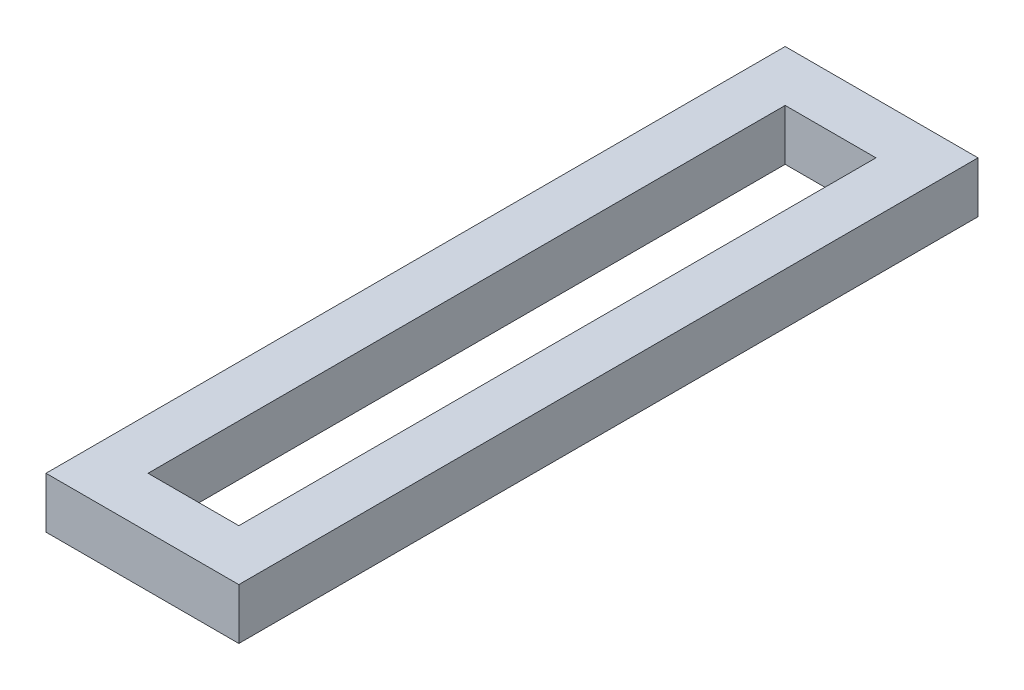
ISO-10303-21;
HEADER;
FILE_DESCRIPTION(('STEP AP214'),'2;1');
FILE_NAME('part.step','',(''),(''),'','','');
FILE_SCHEMA(('AUTOMOTIVE_DESIGN { 1 0 10303 214 1 1 1 1 }'));
ENDSEC;
DATA;
#1=APPLICATION_CONTEXT('core data for automotive mechanical design processes');
#2=APPLICATION_PROTOCOL_DEFINITION('international standard','automotive_design',2000,#1);
#3=PRODUCT_CONTEXT('',#1,'mechanical');
#4=PRODUCT('Part','Part','',(#3));
#5=PRODUCT_RELATED_PRODUCT_CATEGORY('part','',(#4));
#6=PRODUCT_DEFINITION_FORMATION('','',#4);
#7=PRODUCT_DEFINITION_CONTEXT('part definition',#1,'design');
#8=PRODUCT_DEFINITION('design','',#6,#7);
#9=PRODUCT_DEFINITION_SHAPE('','',#8);
#10=(LENGTH_UNIT() NAMED_UNIT(*) SI_UNIT(.MILLI.,.METRE.));
#11=(NAMED_UNIT(*) PLANE_ANGLE_UNIT() SI_UNIT($,.RADIAN.));
#12=(NAMED_UNIT(*) SI_UNIT($,.STERADIAN.) SOLID_ANGLE_UNIT());
#13=UNCERTAINTY_MEASURE_WITH_UNIT(LENGTH_MEASURE(1.E-05),#10,'distance_accuracy_value','');
#14=(GEOMETRIC_REPRESENTATION_CONTEXT(3) GLOBAL_UNCERTAINTY_ASSIGNED_CONTEXT((#13)) GLOBAL_UNIT_ASSIGNED_CONTEXT((#10,
#11,#12)) REPRESENTATION_CONTEXT('',''));
#15=CARTESIAN_POINT('',(0.,0.,0.));
#16=DIRECTION('',(0.,0.,1.));
#17=DIRECTION('',(1.,0.,0.));
#18=AXIS2_PLACEMENT_3D('',#15,#16,#17);
#19=CARTESIAN_POINT('',(0.,15.875,0.));
#20=DIRECTION('',(0.,1.,0.));
#21=DIRECTION('',(0.,0.,1.));
#22=AXIS2_PLACEMENT_3D('',#19,#20,#21);
#23=PLANE('',#22);
#24=DIRECTION('',(0.,0.,1.));
#25=VECTOR('',#24,1.);
#26=CARTESIAN_POINT('',(-30.,15.875,-115.));
#27=LINE('',#26,#25);
#28=CARTESIAN_POINT('',(-30.,15.875,-115.));
#29=VERTEX_POINT('',#28);
#30=CARTESIAN_POINT('',(-30.,15.875,115.));
#31=VERTEX_POINT('',#30);
#32=EDGE_CURVE('E153',#29,#31,#27,.T.);
#33=ORIENTED_EDGE('',*,*,#32,.T.);
#34=DIRECTION('',(1.,0.,0.));
#35=VECTOR('',#34,1.);
#36=CARTESIAN_POINT('',(-30.,15.875,115.));
#37=LINE('',#36,#35);
#38=CARTESIAN_POINT('',(30.,15.875,115.));
#39=VERTEX_POINT('',#38);
#40=EDGE_CURVE('E157',#31,#39,#37,.T.);
#41=ORIENTED_EDGE('',*,*,#40,.T.);
#42=DIRECTION('',(0.,0.,-1.));
#43=VECTOR('',#42,1.);
#44=CARTESIAN_POINT('',(30.,15.875,-115.));
#45=LINE('',#44,#43);
#46=CARTESIAN_POINT('',(30.,15.875,-115.));
#47=VERTEX_POINT('',#46);
#48=EDGE_CURVE('E161',#39,#47,#45,.T.);
#49=ORIENTED_EDGE('',*,*,#48,.T.);
#50=DIRECTION('',(-1.,0.,0.));
#51=VECTOR('',#50,1.);
#52=CARTESIAN_POINT('',(-30.,15.875,-115.));
#53=LINE('',#52,#51);
#54=EDGE_CURVE('E164',#47,#29,#53,.T.);
#55=ORIENTED_EDGE('',*,*,#54,.T.);
#56=EDGE_LOOP('',(#33,#41,#49,#55));
#57=FACE_BOUND('',#56,.T.);
#58=DIRECTION('',(1.,0.,0.));
#59=VECTOR('',#58,1.);
#60=CARTESIAN_POINT('',(-14.125,15.875,99.125));
#61=LINE('',#60,#59);
#62=CARTESIAN_POINT('',(-14.125,15.875,99.125));
#63=VERTEX_POINT('',#62);
#64=CARTESIAN_POINT('',(14.125,15.875,99.125));
#65=VERTEX_POINT('',#64);
#66=EDGE_CURVE('E114',#63,#65,#61,.T.);
#67=ORIENTED_EDGE('',*,*,#66,.F.);
#68=DIRECTION('',(0.,0.,1.));
#69=VECTOR('',#68,1.);
#70=CARTESIAN_POINT('',(-14.125,15.875,-99.125));
#71=LINE('',#70,#69);
#72=CARTESIAN_POINT('',(-14.125,15.875,-99.125));
#73=VERTEX_POINT('',#72);
#74=EDGE_CURVE('E105',#73,#63,#71,.T.);
#75=ORIENTED_EDGE('',*,*,#74,.F.);
#76=DIRECTION('',(-1.,0.,0.));
#77=VECTOR('',#76,1.);
#78=CARTESIAN_POINT('',(-14.125,15.875,-99.125));
#79=LINE('',#78,#77);
#80=CARTESIAN_POINT('',(14.125,15.875,-99.125));
#81=VERTEX_POINT('',#80);
#82=EDGE_CURVE('E131',#81,#73,#79,.T.);
#83=ORIENTED_EDGE('',*,*,#82,.F.);
#84=DIRECTION('',(0.,0.,-1.));
#85=VECTOR('',#84,1.);
#86=CARTESIAN_POINT('',(14.125,15.875,-99.125));
#87=LINE('',#86,#85);
#88=EDGE_CURVE('E127',#65,#81,#87,.T.);
#89=ORIENTED_EDGE('',*,*,#88,.F.);
#90=EDGE_LOOP('',(#67,#75,#83,#89));
#91=FACE_BOUND('',#90,.T.);
#92=ADVANCED_FACE('F39',(#57,#91),#23,.T.);
#93=CARTESIAN_POINT('',(0.,0.,0.));
#94=DIRECTION('',(0.,1.,0.));
#95=DIRECTION('',(0.,0.,1.));
#96=AXIS2_PLACEMENT_3D('',#93,#94,#95);
#97=PLANE('',#96);
#98=DIRECTION('',(0.,0.,1.));
#99=VECTOR('',#98,1.);
#100=CARTESIAN_POINT('',(-30.,0.,-115.));
#101=LINE('',#100,#99);
#102=CARTESIAN_POINT('',(-30.,0.,-115.));
#103=VERTEX_POINT('',#102);
#104=CARTESIAN_POINT('',(-30.,0.,115.));
#105=VERTEX_POINT('',#104);
#106=EDGE_CURVE('E123',#103,#105,#101,.T.);
#107=ORIENTED_EDGE('',*,*,#106,.F.);
#108=DIRECTION('',(-1.,0.,0.));
#109=VECTOR('',#108,1.);
#110=CARTESIAN_POINT('',(-30.,0.,-115.));
#111=LINE('',#110,#109);
#112=CARTESIAN_POINT('',(30.,0.,-115.));
#113=VERTEX_POINT('',#112);
#114=EDGE_CURVE('E158',#113,#103,#111,.T.);
#115=ORIENTED_EDGE('',*,*,#114,.F.);
#116=DIRECTION('',(0.,0.,-1.));
#117=VECTOR('',#116,1.);
#118=CARTESIAN_POINT('',(30.,0.,-115.));
#119=LINE('',#118,#117);
#120=CARTESIAN_POINT('',(30.,0.,115.));
#121=VERTEX_POINT('',#120);
#122=EDGE_CURVE('E174',#121,#113,#119,.T.);
#123=ORIENTED_EDGE('',*,*,#122,.F.);
#124=DIRECTION('',(1.,0.,0.));
#125=VECTOR('',#124,1.);
#126=CARTESIAN_POINT('',(-30.,0.,115.));
#127=LINE('',#126,#125);
#128=EDGE_CURVE('E171',#105,#121,#127,.T.);
#129=ORIENTED_EDGE('',*,*,#128,.F.);
#130=EDGE_LOOP('',(#107,#115,#123,#129));
#131=FACE_BOUND('',#130,.T.);
#132=DIRECTION('',(0.,0.,1.));
#133=VECTOR('',#132,1.);
#134=CARTESIAN_POINT('',(-14.125,0.,-99.125));
#135=LINE('',#134,#133);
#136=CARTESIAN_POINT('',(-14.125,0.,-99.125));
#137=VERTEX_POINT('',#136);
#138=CARTESIAN_POINT('',(-14.125,0.,99.125));
#139=VERTEX_POINT('',#138);
#140=EDGE_CURVE('E63',#137,#139,#135,.T.);
#141=ORIENTED_EDGE('',*,*,#140,.T.);
#142=DIRECTION('',(1.,0.,0.));
#143=VECTOR('',#142,1.);
#144=CARTESIAN_POINT('',(-14.125,0.,99.125));
#145=LINE('',#144,#143);
#146=CARTESIAN_POINT('',(14.125,0.,99.125));
#147=VERTEX_POINT('',#146);
#148=EDGE_CURVE('E121',#139,#147,#145,.T.);
#149=ORIENTED_EDGE('',*,*,#148,.T.);
#150=DIRECTION('',(0.,0.,-1.));
#151=VECTOR('',#150,1.);
#152=CARTESIAN_POINT('',(14.125,0.,-99.125));
#153=LINE('',#152,#151);
#154=CARTESIAN_POINT('',(14.125,0.,-99.125));
#155=VERTEX_POINT('',#154);
#156=EDGE_CURVE('E140',#147,#155,#153,.T.);
#157=ORIENTED_EDGE('',*,*,#156,.T.);
#158=DIRECTION('',(-1.,0.,0.));
#159=VECTOR('',#158,1.);
#160=CARTESIAN_POINT('',(-14.125,0.,-99.125));
#161=LINE('',#160,#159);
#162=EDGE_CURVE('E115',#155,#137,#161,.T.);
#163=ORIENTED_EDGE('',*,*,#162,.T.);
#164=EDGE_LOOP('',(#141,#149,#157,#163));
#165=FACE_BOUND('',#164,.T.);
#166=ADVANCED_FACE('F197',(#131,#165),#97,.F.);
#167=CARTESIAN_POINT('',(-30.,15.875,-115.));
#168=DIRECTION('',(1.,0.,0.));
#169=DIRECTION('',(0.,0.,-1.));
#170=AXIS2_PLACEMENT_3D('',#167,#168,#169);
#171=PLANE('',#170);
#172=ORIENTED_EDGE('',*,*,#106,.T.);
#173=DIRECTION('',(0.,-1.,0.));
#174=VECTOR('',#173,1.);
#175=CARTESIAN_POINT('',(-30.,15.875,115.));
#176=LINE('',#175,#174);
#177=EDGE_CURVE('E11',#31,#105,#176,.T.);
#178=ORIENTED_EDGE('',*,*,#177,.F.);
#179=ORIENTED_EDGE('',*,*,#32,.F.);
#180=DIRECTION('',(0.,-1.,0.));
#181=VECTOR('',#180,1.);
#182=CARTESIAN_POINT('',(-30.,15.875,-115.));
#183=LINE('',#182,#181);
#184=EDGE_CURVE('E167',#29,#103,#183,.T.);
#185=ORIENTED_EDGE('',*,*,#184,.T.);
#186=EDGE_LOOP('',(#172,#178,#179,#185));
#187=FACE_BOUND('',#186,.T.);
#188=ADVANCED_FACE('F41',(#187),#171,.F.);
#189=CARTESIAN_POINT('',(-30.,15.875,115.));
#190=DIRECTION('',(0.,0.,-1.));
#191=DIRECTION('',(-1.,0.,0.));
#192=AXIS2_PLACEMENT_3D('',#189,#190,#191);
#193=PLANE('',#192);
#194=ORIENTED_EDGE('',*,*,#128,.T.);
#195=DIRECTION('',(0.,-1.,0.));
#196=VECTOR('',#195,1.);
#197=CARTESIAN_POINT('',(30.,15.875,115.));
#198=LINE('',#197,#196);
#199=EDGE_CURVE('E48',#39,#121,#198,.T.);
#200=ORIENTED_EDGE('',*,*,#199,.F.);
#201=ORIENTED_EDGE('',*,*,#40,.F.);
#202=ORIENTED_EDGE('',*,*,#177,.T.);
#203=EDGE_LOOP('',(#194,#200,#201,#202));
#204=FACE_BOUND('',#203,.T.);
#205=ADVANCED_FACE('F207',(#204),#193,.F.);
#206=CARTESIAN_POINT('',(30.,15.875,-115.));
#207=DIRECTION('',(-1.,0.,0.));
#208=DIRECTION('',(0.,0.,1.));
#209=AXIS2_PLACEMENT_3D('',#206,#207,#208);
#210=PLANE('',#209);
#211=ORIENTED_EDGE('',*,*,#122,.T.);
#212=DIRECTION('',(0.,-1.,0.));
#213=VECTOR('',#212,1.);
#214=CARTESIAN_POINT('',(30.,15.875,-115.));
#215=LINE('',#214,#213);
#216=EDGE_CURVE('E182',#47,#113,#215,.T.);
#217=ORIENTED_EDGE('',*,*,#216,.F.);
#218=ORIENTED_EDGE('',*,*,#48,.F.);
#219=ORIENTED_EDGE('',*,*,#199,.T.);
#220=EDGE_LOOP('',(#211,#217,#218,#219));
#221=FACE_BOUND('',#220,.T.);
#222=ADVANCED_FACE('F191',(#221),#210,.F.);
#223=CARTESIAN_POINT('',(-30.,15.875,-115.));
#224=DIRECTION('',(0.,0.,1.));
#225=DIRECTION('',(1.,0.,0.));
#226=AXIS2_PLACEMENT_3D('',#223,#224,#225);
#227=PLANE('',#226);
#228=ORIENTED_EDGE('',*,*,#114,.T.);
#229=ORIENTED_EDGE('',*,*,#184,.F.);
#230=ORIENTED_EDGE('',*,*,#54,.F.);
#231=ORIENTED_EDGE('',*,*,#216,.T.);
#232=EDGE_LOOP('',(#228,#229,#230,#231));
#233=FACE_BOUND('',#232,.T.);
#234=ADVANCED_FACE('F201',(#233),#227,.F.);
#235=CARTESIAN_POINT('',(-14.125,15.875,-99.125));
#236=DIRECTION('',(1.,0.,0.));
#237=DIRECTION('',(0.,0.,-1.));
#238=AXIS2_PLACEMENT_3D('',#235,#236,#237);
#239=PLANE('',#238);
#240=ORIENTED_EDGE('',*,*,#140,.F.);
#241=DIRECTION('',(0.,-1.,0.));
#242=VECTOR('',#241,1.);
#243=CARTESIAN_POINT('',(-14.125,15.875,-99.125));
#244=LINE('',#243,#242);
#245=EDGE_CURVE('E109',#73,#137,#244,.T.);
#246=ORIENTED_EDGE('',*,*,#245,.F.);
#247=ORIENTED_EDGE('',*,*,#74,.T.);
#248=DIRECTION('',(0.,-1.,0.));
#249=VECTOR('',#248,1.);
#250=CARTESIAN_POINT('',(-14.125,15.875,99.125));
#251=LINE('',#250,#249);
#252=EDGE_CURVE('E108',#63,#139,#251,.T.);
#253=ORIENTED_EDGE('',*,*,#252,.T.);
#254=EDGE_LOOP('',(#240,#246,#247,#253));
#255=FACE_BOUND('',#254,.T.);
#256=ADVANCED_FACE('F107',(#255),#239,.T.);
#257=CARTESIAN_POINT('',(-14.125,15.875,99.125));
#258=DIRECTION('',(0.,0.,-1.));
#259=DIRECTION('',(-1.,0.,0.));
#260=AXIS2_PLACEMENT_3D('',#257,#258,#259);
#261=PLANE('',#260);
#262=ORIENTED_EDGE('',*,*,#148,.F.);
#263=ORIENTED_EDGE('',*,*,#252,.F.);
#264=ORIENTED_EDGE('',*,*,#66,.T.);
#265=DIRECTION('',(0.,-1.,0.));
#266=VECTOR('',#265,1.);
#267=CARTESIAN_POINT('',(14.125,15.875,99.125));
#268=LINE('',#267,#266);
#269=EDGE_CURVE('E124',#65,#147,#268,.T.);
#270=ORIENTED_EDGE('',*,*,#269,.T.);
#271=EDGE_LOOP('',(#262,#263,#264,#270));
#272=FACE_BOUND('',#271,.T.);
#273=ADVANCED_FACE('F118',(#272),#261,.T.);
#274=CARTESIAN_POINT('',(14.125,15.875,-99.125));
#275=DIRECTION('',(-1.,0.,0.));
#276=DIRECTION('',(0.,0.,1.));
#277=AXIS2_PLACEMENT_3D('',#274,#275,#276);
#278=PLANE('',#277);
#279=ORIENTED_EDGE('',*,*,#156,.F.);
#280=ORIENTED_EDGE('',*,*,#269,.F.);
#281=ORIENTED_EDGE('',*,*,#88,.T.);
#282=DIRECTION('',(0.,-1.,0.));
#283=VECTOR('',#282,1.);
#284=CARTESIAN_POINT('',(14.125,15.875,-99.125));
#285=LINE('',#284,#283);
#286=EDGE_CURVE('E55',#81,#155,#285,.T.);
#287=ORIENTED_EDGE('',*,*,#286,.T.);
#288=EDGE_LOOP('',(#279,#280,#281,#287));
#289=FACE_BOUND('',#288,.T.);
#290=ADVANCED_FACE('F230',(#289),#278,.T.);
#291=CARTESIAN_POINT('',(-14.125,15.875,-99.125));
#292=DIRECTION('',(0.,0.,1.));
#293=DIRECTION('',(1.,0.,0.));
#294=AXIS2_PLACEMENT_3D('',#291,#292,#293);
#295=PLANE('',#294);
#296=ORIENTED_EDGE('',*,*,#162,.F.);
#297=ORIENTED_EDGE('',*,*,#286,.F.);
#298=ORIENTED_EDGE('',*,*,#82,.T.);
#299=ORIENTED_EDGE('',*,*,#245,.T.);
#300=EDGE_LOOP('',(#296,#297,#298,#299));
#301=FACE_BOUND('',#300,.T.);
#302=ADVANCED_FACE('F234',(#301),#295,.T.);
#303=CLOSED_SHELL('',(#92,#166,#188,#205,#222,#234,#256,#273,#290,#302));
#304=MANIFOLD_SOLID_BREP('B2',#303);
#305=ADVANCED_BREP_SHAPE_REPRESENTATION('',(#18,#304),#14);
#306=SHAPE_DEFINITION_REPRESENTATION(#9,#305);
ENDSEC;
END-ISO-10303-21;
